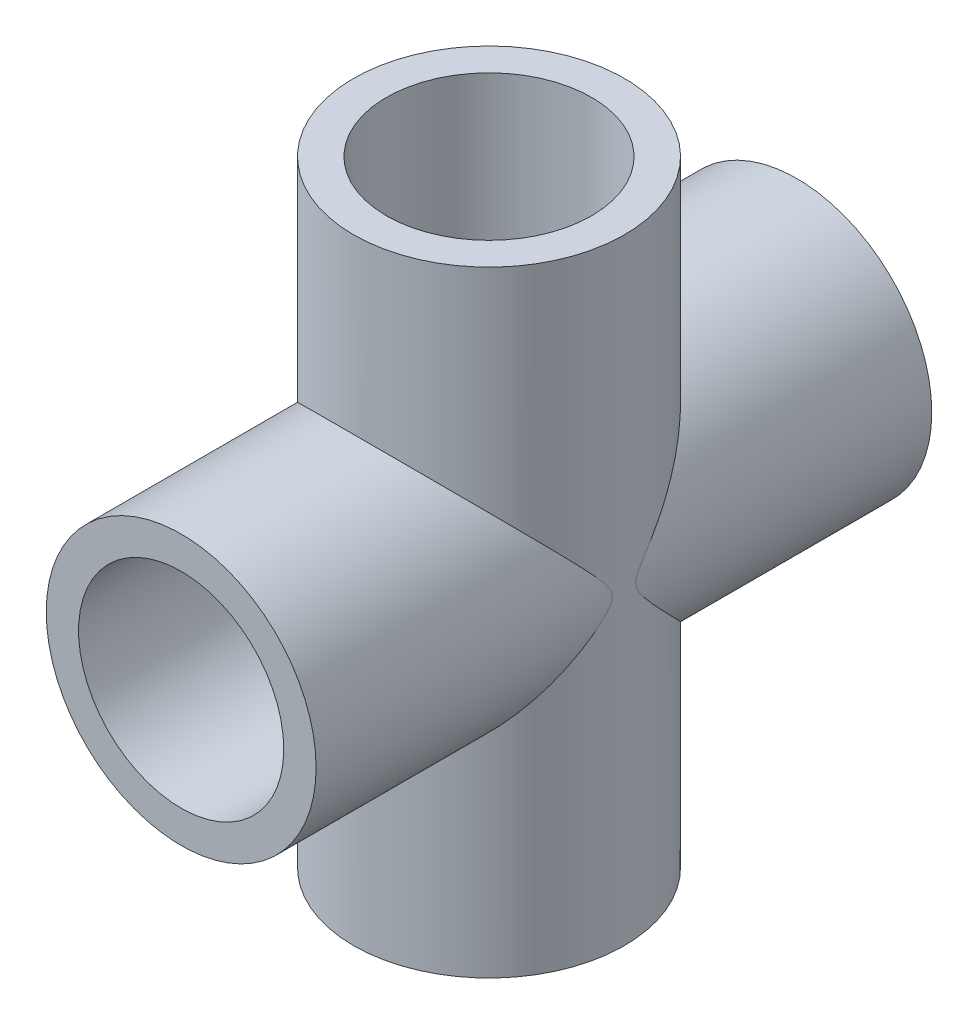
ISO-10303-21;
HEADER;
FILE_DESCRIPTION(('STEP AP214'),'2;1');
FILE_NAME('part.step','',(''),(''),'','','');
FILE_SCHEMA(('AUTOMOTIVE_DESIGN { 1 0 10303 214 1 1 1 1 }'));
ENDSEC;
DATA;
#1=APPLICATION_CONTEXT('core data for automotive mechanical design processes');
#2=APPLICATION_PROTOCOL_DEFINITION('international standard','automotive_design',2000,#1);
#3=PRODUCT_CONTEXT('',#1,'mechanical');
#4=PRODUCT('Part','Part','',(#3));
#5=PRODUCT_RELATED_PRODUCT_CATEGORY('part','',(#4));
#6=PRODUCT_DEFINITION_FORMATION('','',#4);
#7=PRODUCT_DEFINITION_CONTEXT('part definition',#1,'design');
#8=PRODUCT_DEFINITION('design','',#6,#7);
#9=PRODUCT_DEFINITION_SHAPE('','',#8);
#10=(LENGTH_UNIT() NAMED_UNIT(*) SI_UNIT(.MILLI.,.METRE.));
#11=(NAMED_UNIT(*) PLANE_ANGLE_UNIT() SI_UNIT($,.RADIAN.));
#12=(NAMED_UNIT(*) SI_UNIT($,.STERADIAN.) SOLID_ANGLE_UNIT());
#13=UNCERTAINTY_MEASURE_WITH_UNIT(LENGTH_MEASURE(1.E-05),#10,'distance_accuracy_value','');
#14=(GEOMETRIC_REPRESENTATION_CONTEXT(3) GLOBAL_UNCERTAINTY_ASSIGNED_CONTEXT((#13)) GLOBAL_UNIT_ASSIGNED_CONTEXT((#10,
#11,#12)) REPRESENTATION_CONTEXT('',''));
#15=CARTESIAN_POINT('',(0.,0.,0.));
#16=DIRECTION('',(0.,0.,1.));
#17=DIRECTION('',(1.,0.,0.));
#18=AXIS2_PLACEMENT_3D('',#15,#16,#17);
#19=CARTESIAN_POINT('',(0.,0.,76.2));
#20=DIRECTION('',(0.,0.,-1.));
#21=DIRECTION('',(-1.,0.,0.));
#22=AXIS2_PLACEMENT_3D('',#19,#20,#21);
#23=CYLINDRICAL_SURFACE('',#22,12.7);
#24=CARTESIAN_POINT('',(0.,0.,38.1));
#25=DIRECTION('',(0.,-0.707106781186547,-0.707106781186547));
#26=DIRECTION('',(0.,0.707106781186547,-0.707106781186547));
#27=AXIS2_PLACEMENT_3D('',#24,#25,#26);
#28=ELLIPSE('',#27,17.9605122421383,12.7);
#29=CARTESIAN_POINT('',(-12.7,0.,38.1));
#30=VERTEX_POINT('',#29);
#31=CARTESIAN_POINT('',(12.7,0.,38.1));
#32=VERTEX_POINT('',#31);
#33=EDGE_CURVE('E11',#30,#32,#28,.F.);
#34=ORIENTED_EDGE('',*,*,#33,.F.);
#35=CARTESIAN_POINT('',(0.,0.,38.1));
#36=DIRECTION('',(0.,-0.707106781186547,0.707106781186547));
#37=DIRECTION('',(0.,-0.707106781186547,-0.707106781186547));
#38=AXIS2_PLACEMENT_3D('',#35,#36,#37);
#39=ELLIPSE('',#38,17.9605122421383,12.7);
#40=EDGE_CURVE('E55',#30,#32,#39,.F.);
#41=ORIENTED_EDGE('',*,*,#40,.T.);
#42=EDGE_LOOP('',(#34,#41));
#43=FACE_BOUND('',#42,.T.);
#44=CARTESIAN_POINT('',(0.,0.,76.2));
#45=DIRECTION('',(0.,0.,1.));
#46=DIRECTION('',(1.,0.,0.));
#47=AXIS2_PLACEMENT_3D('',#44,#45,#46);
#48=CIRCLE('',#47,12.7);
#49=CARTESIAN_POINT('',(12.7,0.,76.2));
#50=VERTEX_POINT('',#49);
#51=EDGE_CURVE('E131',#50,#50,#48,.T.);
#52=ORIENTED_EDGE('',*,*,#51,.T.);
#53=EDGE_LOOP('',(#52));
#54=FACE_BOUND('',#53,.T.);
#55=ADVANCED_FACE('F32',(#43,#54),#23,.F.);
#56=CARTESIAN_POINT('',(0.,0.,76.2));
#57=DIRECTION('',(0.,0.,-1.));
#58=DIRECTION('',(-1.,0.,0.));
#59=AXIS2_PLACEMENT_3D('',#56,#57,#58);
#60=CYLINDRICAL_SURFACE('',#59,16.7005);
#61=CARTESIAN_POINT('',(0.,0.,76.2));
#62=DIRECTION('',(0.,0.,1.));
#63=DIRECTION('',(1.,0.,0.));
#64=AXIS2_PLACEMENT_3D('',#61,#62,#63);
#65=CIRCLE('',#64,16.7005);
#66=CARTESIAN_POINT('',(16.7005,0.,76.2));
#67=VERTEX_POINT('',#66);
#68=EDGE_CURVE('E86',#67,#67,#65,.T.);
#69=ORIENTED_EDGE('',*,*,#68,.F.);
#70=EDGE_LOOP('',(#69));
#71=FACE_BOUND('',#70,.T.);
#72=CARTESIAN_POINT('',(-16.7005,0.,39.5577365159727));
#73=CARTESIAN_POINT('',(-16.7004971946877,0.109377941611849,39.5577881761286));
#74=CARTESIAN_POINT('',(-16.6994042441671,0.218833310366565,39.5704513220979));
#75=CARTESIAN_POINT('',(-16.6952279831685,0.433349002507215,39.6170762949017));
#76=CARTESIAN_POINT('',(-16.6921317169307,0.538375943308756,39.6511767189807));
#77=CARTESIAN_POINT('',(-16.6838144556186,0.755140052959844,39.7383410327404));
#78=CARTESIAN_POINT('',(-16.6783775616868,0.866093816107272,39.7932323789569));
#79=CARTESIAN_POINT('',(-16.6657478078138,1.08226559654692,39.9133453628733));
#80=CARTESIAN_POINT('',(-16.6585507741035,1.18746924240747,39.9785914233685));
#81=CARTESIAN_POINT('',(-16.6425139811608,1.39436878573821,40.115746845307));
#82=CARTESIAN_POINT('',(-16.633662423503,1.49603284494996,40.1877020771601));
#83=CARTESIAN_POINT('',(-16.6144480732112,1.69613718046101,40.3354833615605));
#84=CARTESIAN_POINT('',(-16.6040870705458,1.79458110833297,40.4113047611527));
#85=CARTESIAN_POINT('',(-16.5678042083091,2.11285815155546,40.6633227126372));
#86=CARTESIAN_POINT('',(-16.5388239334411,2.32816370963601,40.8447667174249));
#87=CARTESIAN_POINT('',(-16.4734527962265,2.75281906209883,41.213250812085));
#88=CARTESIAN_POINT('',(-16.4370583403272,2.96216591208411,41.4002935779557));
#89=CARTESIAN_POINT('',(-16.3568184553963,3.37726985372258,41.7774158406208));
#90=CARTESIAN_POINT('',(-16.3129615282301,3.5830208571684,41.9674996072154));
#91=CARTESIAN_POINT('',(-16.2178226373663,3.99160010086575,42.3488336550599));
#92=CARTESIAN_POINT('',(-16.1665422115659,4.19442893694534,42.5400836868578));
#93=CARTESIAN_POINT('',(-16.0017768968227,4.79831329615684,43.1132284540607));
#94=CARTESIAN_POINT('',(-15.8771399194564,5.19594081635482,43.4956037245185));
#95=CARTESIAN_POINT('',(-15.5976015091929,5.98294344320413,44.2572070064692));
#96=CARTESIAN_POINT('',(-15.4427181927199,6.37232333588253,44.6364367609584));
#97=CARTESIAN_POINT('',(-15.0504369928404,7.25890832642233,45.5030680079411));
#98=CARTESIAN_POINT('',(-14.8022406199555,7.75322242679633,45.9886058968734));
#99=CARTESIAN_POINT('',(-14.2509760219082,8.72516959857842,46.945711744899));
#100=CARTESIAN_POINT('',(-13.9478806057969,9.20279426340525,47.4172726460462));
#101=CARTESIAN_POINT('',(-13.2847749421974,10.1365250866551,48.3405712003102));
#102=CARTESIAN_POINT('',(-12.9248096057687,10.592647859479,48.7923241394311));
#103=CARTESIAN_POINT('',(-12.1454197849747,11.4779298351004,49.6699844262983));
#104=CARTESIAN_POINT('',(-11.7260365098409,11.9071074304503,50.0959093970672));
#105=CARTESIAN_POINT('',(-10.9945170038697,12.5766755760574,50.7608395975585));
#106=CARTESIAN_POINT('',(-10.7011206718141,12.8275198743983,51.010055686369));
#107=CARTESIAN_POINT('',(-10.0898414119314,13.3136869959685,51.4932269916807));
#108=CARTESIAN_POINT('',(-9.77196075006493,13.5490112518045,51.7271836167129));
#109=CARTESIAN_POINT('',(-9.11203894729865,14.0013309725647,52.176991875005));
#110=CARTESIAN_POINT('',(-8.77002912563001,14.2183494226331,52.3928662103069));
#111=CARTESIAN_POINT('',(-8.06180913310757,14.63153830433,52.8039612861403));
#112=CARTESIAN_POINT('',(-7.69560288265102,14.8277120999202,52.9991853592387));
#113=CARTESIAN_POINT('',(-7.00637065900624,15.1636904396835,53.3335908035655));
#114=CARTESIAN_POINT('',(-6.68706983845536,15.3073420561721,53.4765911913435));
#115=CARTESIAN_POINT('',(-6.03361467621218,15.5764884462261,53.7445462716977));
#116=CARTESIAN_POINT('',(-5.69946352186493,15.7019870916172,53.8695048123879));
#117=CARTESIAN_POINT('',(-5.01771485701723,15.9329443705381,54.0994874861398));
#118=CARTESIAN_POINT('',(-4.67012105297363,16.0384084813136,54.204517067575));
#119=CARTESIAN_POINT('',(-3.96326901171396,16.2275391568857,54.3928803586232));
#120=CARTESIAN_POINT('',(-3.60401068440611,16.311205553281,54.4762139006203));
#121=CARTESIAN_POINT('',(-2.87368534667217,16.455641434504,54.6200814001919));
#122=CARTESIAN_POINT('',(-2.50255326719795,16.5162464989572,54.6804516351712));
#123=CARTESIAN_POINT('',(-1.7538545920992,16.6124388527953,54.7762736416118));
#124=CARTESIAN_POINT('',(-1.37628797058831,16.6480260415081,54.8117253128009));
#125=CARTESIAN_POINT('',(-0.618212359159072,16.6933711926294,54.8568980905866));
#126=CARTESIAN_POINT('',(-0.237704553993179,16.7031390618951,54.8666290661986));
#127=CARTESIAN_POINT('',(0.522846620795012,16.6966437967895,54.860158403037));
#128=CARTESIAN_POINT('',(0.902890028588318,16.6803829692777,54.8439590624039));
#129=CARTESIAN_POINT('',(1.61605969780274,16.6255253464845,54.7893104696267));
#130=CARTESIAN_POINT('',(1.94961448314265,16.5896736608336,54.7535957657123));
#131=CARTESIAN_POINT('',(2.6113276693388,16.4984602799764,54.6627344151639));
#132=CARTESIAN_POINT('',(2.93948656797637,16.4431003951299,54.6075895716458));
#133=CARTESIAN_POINT('',(3.58841718195762,16.3137809223338,54.4787792861818));
#134=CARTESIAN_POINT('',(3.90918840304576,16.2398200938541,54.4051126089817));
#135=CARTESIAN_POINT('',(4.54162240193788,16.0744275028447,54.2403890937314));
#136=CARTESIAN_POINT('',(4.85328463027853,15.9829946888852,54.1493312091127));
#137=CARTESIAN_POINT('',(5.47913529912896,15.7796891940698,53.9468765638436));
#138=CARTESIAN_POINT('',(5.79286773258255,15.667112741553,53.8347796476714));
#139=CARTESIAN_POINT('',(6.40771197568703,15.4258552059127,53.5945757536515));
#140=CARTESIAN_POINT('',(6.70882383367645,15.2971741844794,53.4664688371317));
#141=CARTESIAN_POINT('',(7.29767109354589,15.0251756733772,53.195718934967));
#142=CARTESIAN_POINT('',(7.58540334464515,14.8818547612894,53.053072550396));
#143=CARTESIAN_POINT('',(8.14691768873243,14.5820362906594,52.7547112052524));
#144=CARTESIAN_POINT('',(8.42069673206444,14.4255358712203,52.5989934072704));
#145=CARTESIAN_POINT('',(9.0989298012114,14.012435988985,52.1880341449431));
#146=CARTESIAN_POINT('',(9.49354758822166,13.7476557864667,51.9246935012395));
#147=CARTESIAN_POINT('',(10.2485226696862,13.1944574023431,51.3747058662491));
#148=CARTESIAN_POINT('',(10.6088652950383,12.9060291973056,51.0880489925677));
#149=CARTESIAN_POINT('',(11.2964581898908,12.3087205559965,50.4946929414861));
#150=CARTESIAN_POINT('',(11.6236261397893,11.9997922456727,50.1879468731337));
#151=CARTESIAN_POINT('',(12.2446357648759,11.3654142513624,49.5584511030661));
#152=CARTESIAN_POINT('',(12.5384782421173,11.0399649652638,49.2357017867741));
#153=CARTESIAN_POINT('',(13.2001721119357,10.247970342333,48.4509416631894));
#154=CARTESIAN_POINT('',(13.5533244273638,9.77508283402438,47.9828953557696));
#155=CARTESIAN_POINT('',(14.2006346440247,8.80836563732624,47.0278606111641));
#156=CARTESIAN_POINT('',(14.4947635931303,8.31452581458837,46.5408630171498));
#157=CARTESIAN_POINT('',(15.0261057459156,7.3106165745748,45.5539492906826));
#158=CARTESIAN_POINT('',(15.2633781188113,6.80056466063715,45.0540471932473));
#159=CARTESIAN_POINT('',(15.5783301691151,6.02495416655496,44.2985292768195));
#160=CARTESIAN_POINT('',(15.6764761593502,5.76470271519629,44.0457851321397));
#161=CARTESIAN_POINT('',(15.8593704264658,5.24062241071755,43.5391682774392));
#162=CARTESIAN_POINT('',(15.9441196365541,4.97679380816998,43.2852956472955));
#163=CARTESIAN_POINT('',(16.1089450275244,4.41622301922161,42.74977814086));
#164=CARTESIAN_POINT('',(16.1874974431869,4.11903578832237,42.4681312993222));
#165=CARTESIAN_POINT('',(16.3284719284011,3.51893098982689,41.9073515844358));
#166=CARTESIAN_POINT('',(16.3909071950102,3.21601832987026,41.6282168360645));
#167=CARTESIAN_POINT('',(16.4808612513591,2.7072885195394,41.1735233057384));
#168=CARTESIAN_POINT('',(16.5129739444785,2.50431093134066,40.9956804601354));
#169=CARTESIAN_POINT('',(16.5703554191,2.0913521764185,40.6467548408669));
#170=CARTESIAN_POINT('',(16.5956219123607,1.88136869435109,40.475674343695));
#171=CARTESIAN_POINT('',(16.6303456877539,1.53470269896479,40.214983667898));
#172=CARTESIAN_POINT('',(16.6420870592141,1.40223155303702,40.1201198853233));
#173=CARTESIAN_POINT('',(16.6628165045685,1.1296056387351,39.9412506854416));
#174=CARTESIAN_POINT('',(16.6718053251459,0.989452966309142,39.8572423269696));
#175=CARTESIAN_POINT('',(16.6838151142341,0.75192286887624,39.7383500333531));
#176=CARTESIAN_POINT('',(16.6878122962417,0.658020970420006,39.6968157101605));
#177=CARTESIAN_POINT('',(16.6942945985817,0.465251318751511,39.6275599552889));
#178=CARTESIAN_POINT('',(16.6967846780986,0.366401023997692,39.5997932757278));
#179=CARTESIAN_POINT('',(16.6997248767064,0.181533409722611,39.5666749972553));
#180=CARTESIAN_POINT('',(16.7004426181088,0.0960708322746923,39.5583936810184));
#181=CARTESIAN_POINT('',(16.7005506669624,-0.0748912330378882,39.5571562790181));
#182=CARTESIAN_POINT('',(16.6999422164908,-0.160390611447141,39.5641858534635));
#183=CARTESIAN_POINT('',(16.6971083977953,-0.35384356265999,39.5961858326484));
#184=CARTESIAN_POINT('',(16.6944590524759,-0.460981946299804,39.6258363401814));
#185=CARTESIAN_POINT('',(16.6873993123283,-0.669652510648679,39.7011935492045));
#186=CARTESIAN_POINT('',(16.6829786996375,-0.771148203188232,39.7469932227392));
#187=CARTESIAN_POINT('',(16.6692357370303,-1.03467717021753,39.8819451065387));
#188=CARTESIAN_POINT('',(16.6586084237604,-1.19210027715894,39.9796768304122));
#189=CARTESIAN_POINT('',(16.6338533551076,-1.49839954480143,40.1875355450997));
#190=CARTESIAN_POINT('',(16.6197148220498,-1.64724761828511,40.2977001196323));
#191=CARTESIAN_POINT('',(16.5880463684486,-1.94042545100835,40.5252190034094));
#192=CARTESIAN_POINT('',(16.5704962540407,-2.08472204593027,40.6426131298173));
#193=CARTESIAN_POINT('',(16.5321720596972,-2.36950646997783,40.8809321525774));
#194=CARTESIAN_POINT('',(16.5114028702622,-2.50999970310247,41.0018514707836));
#195=CARTESIAN_POINT('',(16.4444486432232,-2.92676379448886,41.3669095336551));
#196=CARTESIAN_POINT('',(16.3934917165784,-3.19944980849916,41.6142717139342));
#197=CARTESIAN_POINT('',(16.2788286278479,-3.73930254412422,42.1120997513183));
#198=CARTESIAN_POINT('',(16.2151194481716,-4.00646794284555,42.3625663298388));
#199=CARTESIAN_POINT('',(16.0747612196812,-4.53697443069057,42.8646364773455));
#200=CARTESIAN_POINT('',(15.9980957476251,-4.80031019946608,43.1162410899392));
#201=CARTESIAN_POINT('',(15.8317382307769,-5.3233487217964,43.6188646496097));
#202=CARTESIAN_POINT('',(15.742047379626,-5.58305180586097,43.8698836482126));
#203=CARTESIAN_POINT('',(15.5497422811087,-6.09815967290197,44.3696630436253));
#204=CARTESIAN_POINT('',(15.4471694166436,-6.35357537596929,44.6184280533976));
#205=CARTESIAN_POINT('',(15.228669842484,-6.86079887157115,45.1137436036806));
#206=CARTESIAN_POINT('',(15.1127426924646,-7.11260654483178,45.3602940708832));
#207=CARTESIAN_POINT('',(14.7446963642306,-7.86195638951252,46.095362152033));
#208=CARTESIAN_POINT('',(14.4721612240776,-8.35383282073925,46.5796932171819));
#209=CARTESIAN_POINT('',(13.9240505314982,-9.2328725062245,47.4470264510503));
#210=CARTESIAN_POINT('',(13.6576311009812,-9.62310420381735,47.8327338689883));
#211=CARTESIAN_POINT('',(13.0850661041771,-10.3882662437671,48.5899002370064));
#212=CARTESIAN_POINT('',(12.7789153507437,-10.7631945797683,48.961357318407));
#213=CARTESIAN_POINT('',(12.1257830121768,-11.4940020219734,49.6859762323605));
#214=CARTESIAN_POINT('',(11.7788349731252,-11.8498964335275,50.0391527568872));
#215=CARTESIAN_POINT('',(11.0426855158628,-12.5387280396919,50.7231147827487));
#216=CARTESIAN_POINT('',(10.6535005138663,-12.8716740719477,51.0539089028575));
#217=CARTESIAN_POINT('',(9.94886415440954,-13.4188416329112,51.5977658323323));
#218=CARTESIAN_POINT('',(9.64389814709539,-13.639909807907,51.8175668413048));
#219=CARTESIAN_POINT('',(9.0118277600854,-14.065517311743,52.2408371848254));
#220=CARTESIAN_POINT('',(8.68472499014032,-14.2700578400797,52.444307704554));
#221=CARTESIAN_POINT('',(8.00905020140445,-14.6599382034647,52.8322232789863));
#222=CARTESIAN_POINT('',(7.66050148623438,-14.8452983127021,53.0166884219453));
#223=CARTESIAN_POINT('',(6.94243536491331,-15.1943594142217,53.3641170568847));
#224=CARTESIAN_POINT('',(6.57292147970828,-15.3580640280903,53.5270841441092));
#225=CARTESIAN_POINT('',(5.87914046479447,-15.6351254932654,53.8029298893534));
#226=CARTESIAN_POINT('',(5.55790876815175,-15.7523071504598,53.9196105762249));
#227=CARTESIAN_POINT('',(4.90332770196237,-15.9681804330761,54.1345777753451));
#228=CARTESIAN_POINT('',(4.56998073381331,-16.0668756991216,54.2328679093393));
#229=CARTESIAN_POINT('',(3.89293497443916,-16.2442038058654,54.4094785193721));
#230=CARTESIAN_POINT('',(3.54924018801426,-16.3228442993255,54.4878066127792));
#231=CARTESIAN_POINT('',(2.85349147727876,-16.4587332744007,54.6231613344299));
#232=CARTESIAN_POINT('',(2.50143747061554,-16.5159815451727,54.6801877527229));
#233=CARTESIAN_POINT('',(1.78977648504214,-16.6082133378475,54.7720643461588));
#234=CARTESIAN_POINT('',(1.43014115848807,-16.6430875460863,54.8068056420415));
#235=CARTESIAN_POINT('',(0.70786411509884,-16.6894151269827,54.8529570207472));
#236=CARTESIAN_POINT('',(0.345222393654528,-16.7008684637269,54.864367067794));
#237=CARTESIAN_POINT('',(-0.37997278190831,-16.7001134591284,54.8636149235353));
#238=CARTESIAN_POINT('',(-0.742526241256664,-16.6879075303051,54.8514551356299));
#239=CARTESIAN_POINT('',(-1.46452681619334,-16.6400944770499,54.803823981458));
#240=CARTESIAN_POINT('',(-1.82397404742528,-16.6044882276383,54.7683534868609));
#241=CARTESIAN_POINT('',(-2.5093783934049,-16.5142318429873,54.6784448852182));
#242=CARTESIAN_POINT('',(-2.83578044118749,-16.4612621562355,54.6256805369926));
#243=CARTESIAN_POINT('',(-3.48146835329843,-16.3368958510236,54.5018026900799));
#244=CARTESIAN_POINT('',(-3.80075481647235,-16.2655007896485,54.4306907419054));
#245=CARTESIAN_POINT('',(-4.43058879653931,-16.1053469493424,54.2711825327218));
#246=CARTESIAN_POINT('',(-4.74113435718152,-16.0165843182693,54.1827824371888));
#247=CARTESIAN_POINT('',(-5.35206251284874,-15.8229222413758,53.9899271908944));
#248=CARTESIAN_POINT('',(-5.65244313589478,-15.7180196860864,53.885468946422));
#249=CARTESIAN_POINT('',(-6.33903396162662,-15.4563613620895,53.6249447307052));
#250=CARTESIAN_POINT('',(-6.72093852001559,-15.2939052669126,53.4632110928211));
#251=CARTESIAN_POINT('',(-7.4631048753631,-14.9457989979111,53.1167115045902));
#252=CARTESIAN_POINT('',(-7.82336091266575,-14.7601426917036,52.9319394646593));
#253=CARTESIAN_POINT('',(-8.52164898963792,-14.3683219525147,52.5420666760751));
#254=CARTESIAN_POINT('',(-8.85965287356519,-14.1621323367175,52.3369409660625));
#255=CARTESIAN_POINT('',(-9.51253687663765,-13.7321223546547,51.9092606981424));
#256=CARTESIAN_POINT('',(-9.82741585633397,-13.5083011207392,51.6867052825243));
#257=CARTESIAN_POINT('',(-10.5437819748864,-12.961684280244,51.1433533748708));
#258=CARTESIAN_POINT('',(-10.9354316046256,-12.6323576818181,50.8161255611257));
#259=CARTESIAN_POINT('',(-11.6767208673117,-11.9505095576545,50.1390222813422));
#260=CARTESIAN_POINT('',(-12.0263454725649,-11.5979798040447,49.7891387822861));
#261=CARTESIAN_POINT('',(-12.6854857252126,-10.8731617123777,49.0703445309967));
#262=CARTESIAN_POINT('',(-12.994908113909,-10.5008301604785,48.701392218476));
#263=CARTESIAN_POINT('',(-13.5741147113436,-9.74055880150926,47.948884310526));
#264=CARTESIAN_POINT('',(-13.8439007639144,-9.35261972155199,47.5653293954371));
#265=CARTESIAN_POINT('',(-14.2642854842871,-8.69120039664211,46.9124986370356));
#266=CARTESIAN_POINT('',(-14.4252469295607,-8.42119416696529,46.6462980436001));
#267=CARTESIAN_POINT('',(-14.7300654944841,-7.87587791547306,46.1095027965202));
#268=CARTESIAN_POINT('',(-14.8739210687909,-7.60056741707721,45.838907748387));
#269=CARTESIAN_POINT('',(-15.1449500806872,-7.04505226762903,45.2940812001073));
#270=CARTESIAN_POINT('',(-15.2721141264537,-6.76484496090534,45.0198477474736));
#271=CARTESIAN_POINT('',(-15.5099909186737,-6.20006190556572,44.4688238588786));
#272=CARTESIAN_POINT('',(-15.620705218542,-5.91548657224366,44.1920336669859));
#273=CARTESIAN_POINT('',(-15.8256015792983,-5.34313638442774,43.6379523290158));
#274=CARTESIAN_POINT('',(-15.9198443040162,-5.05537760642645,43.3606669908406));
#275=CARTESIAN_POINT('',(-16.0925689675432,-4.47521511045564,42.8058861017224));
#276=CARTESIAN_POINT('',(-16.171046401592,-4.18281009055501,42.5283905133738));
#277=CARTESIAN_POINT('',(-16.3123817898295,-3.59238726140146,41.9754445655107));
#278=CARTESIAN_POINT('',(-16.3752423813432,-3.29437040901523,41.6999938682938));
#279=CARTESIAN_POINT('',(-16.4578623861993,-2.84059987151019,41.2921424074956));
#280=CARTESIAN_POINT('',(-16.4834524469787,-2.68825659116854,41.1571114641748));
#281=CARTESIAN_POINT('',(-16.5307333801916,-2.38030682991,40.8901373069488));
#282=CARTESIAN_POINT('',(-16.552424981557,-2.22470096511813,40.7581935198302));
#283=CARTESIAN_POINT('',(-16.5911661773112,-1.91404232914028,40.5043324648337));
#284=CARTESIAN_POINT('',(-16.6083518575724,-1.7591614394486,40.3822258528447));
#285=CARTESIAN_POINT('',(-16.6388839079133,-1.44210620285471,40.1476816433456));
#286=CARTESIAN_POINT('',(-16.652239143411,-1.27994971852653,40.0352221481665));
#287=CARTESIAN_POINT('',(-16.6704587441075,-1.00670305754688,39.8696433290742));
#288=CARTESIAN_POINT('',(-16.6766215493679,-0.899605421984924,39.8102075014641));
#289=CARTESIAN_POINT('',(-16.6870684722541,-0.678681435737127,39.7050560280454));
#290=CARTESIAN_POINT('',(-16.6913574169905,-0.564873241298256,39.6593052264188));
#291=CARTESIAN_POINT('',(-16.6964494775248,-0.374894319431464,39.6035812761558));
#292=CARTESIAN_POINT('',(-16.6979578704308,-0.300852180494259,39.5866190987592));
#293=CARTESIAN_POINT('',(-16.6999827187964,-0.151215748697161,39.5636941907989));
#294=CARTESIAN_POINT('',(-16.7005019396564,-0.075626381960889,39.5577007969728));
#295=CARTESIAN_POINT('',(-16.7005,0.,39.5577365159727));
#296=B_SPLINE_CURVE_WITH_KNOTS('',3,(#72,#73,#74,#75,#76,#77,#78,#79,#80,#81,#82,#83,#84,#85,
#86,#87,#88,#89,#90,#91,#92,#93,#94,#95,#96,#97,#98,#99,#100,#101,#102,#103,#104,#105,#106,#107,
#108,#109,#110,#111,#112,#113,#114,#115,#116,#117,#118,#119,#120,#121,#122,#123,#124,#125,#126,
#127,#128,#129,#130,#131,#132,#133,#134,#135,#136,#137,#138,#139,#140,#141,#142,#143,#144,#145,
#146,#147,#148,#149,#150,#151,#152,#153,#154,#155,#156,#157,#158,#159,#160,#161,#162,#163,#164,
#165,#166,#167,#168,#169,#170,#171,#172,#173,#174,#175,#176,#177,#178,#179,#180,#181,#182,#183,
#184,#185,#186,#187,#188,#189,#190,#191,#192,#193,#194,#195,#196,#197,#198,#199,#200,#201,#202,
#203,#204,#205,#206,#207,#208,#209,#210,#211,#212,#213,#214,#215,#216,#217,#218,#219,#220,#221,
#222,#223,#224,#225,#226,#227,#228,#229,#230,#231,#232,#233,#234,#235,#236,#237,#238,#239,#240,
#241,#242,#243,#244,#245,#246,#247,#248,#249,#250,#251,#252,#253,#254,#255,#256,#257,#258,#259,
#260,#261,#262,#263,#264,#265,#266,#267,#268,#269,#270,#271,#272,#273,#274,#275,#276,#277,#278,
#279,#280,#281,#282,#283,#284,#285,#286,#287,#288,#289,#290,#291,#292,#293,#294,#295),
.UNSPECIFIED.,.T.,.F.,(4,2,2,2,2,2,2,2,2,2,2,2,2,2,2,2,2,2,2,2,2,2,2,2,2,2,2,2,2,2,2,2,2,2,2,2,
2,2,2,2,2,2,2,2,2,2,2,2,2,2,2,2,2,2,2,2,2,2,2,2,2,2,2,2,2,2,2,2,2,2,2,2,2,2,2,2,2,2,2,2,2,2,2,2,
2,2,2,2,2,2,2,2,2,2,2,2,2,2,2,2,2,2,2,2,2,2,2,2,2,2,2,4),(0.,0.327735287216822,
0.657611567124788,1.02840239435844,1.4000811405967,1.77451910915954,2.14851661284984,
2.99723388176963,3.84636349533043,4.69681349087164,5.5470875534646,7.24279583433119,
8.93749154751042,11.1432019235286,13.3500077681857,15.5550794959982,17.758629318284,
19.1360418096651,20.5133269779444,21.8888562253561,23.2641631482359,24.3977167195367,
25.5310281588906,26.6640293146679,27.7970392233448,28.9379821945265,30.0789297568404,
31.2194394746748,32.3598481175248,33.3707984171602,34.3816549253657,35.3925788672862,
36.4035636637953,37.4575334992777,38.5114992975428,39.5657120514652,40.6201542378506,
42.2475965712697,43.8757323136015,45.5078140232224,47.1398564447498,49.3963336100022,
51.6539149307706,53.9091365393979,55.0364008112517,56.1635865242447,57.4140002366635,
58.6633868131226,59.478593327133,60.2940719767488,60.7839250345688,61.2736450922338,
61.5812447965762,61.8878267488497,62.1441187384125,62.4001707946331,62.7317453354031,
63.0652608119645,63.6204911614105,64.1774473214905,64.7378065370071,65.2973226374324,
66.4119644684716,67.526870371873,68.6432002650357,69.7594279225876,70.8721573195047,
71.9849234164461,74.2086947918637,76.0370812446842,77.8657066441675,79.6928388114857,
81.519263354667,82.8265422662984,84.1337262165868,85.4395140141204,86.7450831596227,
87.8279211685114,88.9105457036062,89.9927564964381,91.0749779553243,92.1624473825251,
93.2499184772505,94.3372786891112,95.4245982430611,96.4280630020331,97.4314429883195,
98.4350457779566,99.438842161339,100.773157355832,102.107825991447,103.444152159608,
104.780544129346,106.600015882908,108.420136336415,110.244406349695,112.068591473338,
113.303954627618,114.539429299853,115.77559618363,117.011646256964,118.243043440286,
119.474791983045,120.706332370241,121.321804013879,121.937160456949,122.530942404095,
123.123338766196,123.490769530892,123.857248122588,124.084487936074,124.311091524036),.UNSPECIFIED.);
#297=CARTESIAN_POINT('',(-16.7005,0.,39.5577365159727));
#298=VERTEX_POINT('',#297);
#299=EDGE_CURVE('E51',#298,#298,#296,.T.);
#300=ORIENTED_EDGE('',*,*,#299,.F.);
#301=EDGE_LOOP('',(#300));
#302=FACE_BOUND('',#301,.T.);
#303=ADVANCED_FACE('F34',(#71,#302),#60,.T.);
#304=CARTESIAN_POINT('',(0.,0.,76.2));
#305=DIRECTION('',(0.,0.,1.));
#306=DIRECTION('',(1.,0.,0.));
#307=AXIS2_PLACEMENT_3D('',#304,#305,#306);
#308=PLANE('',#307);
#309=ORIENTED_EDGE('',*,*,#68,.T.);
#310=EDGE_LOOP('',(#309));
#311=FACE_BOUND('',#310,.T.);
#312=ORIENTED_EDGE('',*,*,#51,.F.);
#313=EDGE_LOOP('',(#312));
#314=FACE_BOUND('',#313,.T.);
#315=ADVANCED_FACE('F96',(#311,#314),#308,.T.);
#316=CARTESIAN_POINT('',(0.,38.1,38.1));
#317=DIRECTION('',(0.,-1.,0.));
#318=DIRECTION('',(0.,0.,-1.));
#319=AXIS2_PLACEMENT_3D('',#316,#317,#318);
#320=CYLINDRICAL_SURFACE('',#319,16.764);
#321=CARTESIAN_POINT('',(-16.7005,0.,36.6422634840273));
#322=CARTESIAN_POINT('',(-16.7004971946877,-0.109377941611843,36.6422118238714));
#323=CARTESIAN_POINT('',(-16.6994042441671,-0.218833310366562,36.6295486779021));
#324=CARTESIAN_POINT('',(-16.6952279831685,-0.433349002507202,36.5829237050982));
#325=CARTESIAN_POINT('',(-16.6921317169307,-0.53837594330873,36.5488232810193));
#326=CARTESIAN_POINT('',(-16.6838144556186,-0.755140052959788,36.4616589672596));
#327=CARTESIAN_POINT('',(-16.6783775616868,-0.866093816107204,36.4067676210431));
#328=CARTESIAN_POINT('',(-16.6657478078138,-1.08226559654682,36.2866546371268));
#329=CARTESIAN_POINT('',(-16.6585507741035,-1.18746924240735,36.2214085766315));
#330=CARTESIAN_POINT('',(-16.6425139811608,-1.39436878573804,36.0842531546931));
#331=CARTESIAN_POINT('',(-16.633662423503,-1.49603284494977,36.01229792284));
#332=CARTESIAN_POINT('',(-16.6144480732112,-1.69613718046078,35.8645166384397));
#333=CARTESIAN_POINT('',(-16.6040870705459,-1.79458110833273,35.7886952388475));
#334=CARTESIAN_POINT('',(-16.5678042083092,-2.11285815155517,35.5366772873631));
#335=CARTESIAN_POINT('',(-16.5388239334411,-2.32816370963568,35.3552332825754));
#336=CARTESIAN_POINT('',(-16.4734527962265,-2.7528190620984,34.9867491879154));
#337=CARTESIAN_POINT('',(-16.4370583403272,-2.96216591208364,34.7997064220447));
#338=CARTESIAN_POINT('',(-16.3568184553964,-3.37726985372202,34.4225841593797));
#339=CARTESIAN_POINT('',(-16.3129615282303,-3.58302085716781,34.2325003927851));
#340=CARTESIAN_POINT('',(-16.2178226373665,-3.99160010086509,33.8511663449407));
#341=CARTESIAN_POINT('',(-16.1665422115661,-4.19442893694463,33.6599163131429));
#342=CARTESIAN_POINT('',(-16.001776896823,-4.798313296156,33.0867715459401));
#343=CARTESIAN_POINT('',(-15.8771399194567,-5.19594081635389,32.7043962754823));
#344=CARTESIAN_POINT('',(-15.5976015091933,-5.98294344320304,31.9427929935318));
#345=CARTESIAN_POINT('',(-15.4427181927203,-6.37232333588137,31.5635632390428));
#346=CARTESIAN_POINT('',(-15.0504369928409,-7.25890832642116,30.69693199206));
#347=CARTESIAN_POINT('',(-14.8022406199561,-7.75322242679523,30.2113941031277));
#348=CARTESIAN_POINT('',(-14.2509760219089,-8.72516959857744,29.254288255102));
#349=CARTESIAN_POINT('',(-13.9478806057975,-9.20279426340433,28.7827273539547));
#350=CARTESIAN_POINT('',(-13.284774942198,-10.1365250866543,27.8594287996906));
#351=CARTESIAN_POINT('',(-12.9248096057693,-10.5926478594782,27.4076758605696));
#352=CARTESIAN_POINT('',(-12.1454197849753,-11.4779298350998,26.5300155737023));
#353=CARTESIAN_POINT('',(-11.7260365098415,-11.9071074304497,26.1040906029333));
#354=CARTESIAN_POINT('',(-10.9945170038703,-12.5766755760569,25.439160402442));
#355=CARTESIAN_POINT('',(-10.7011206718147,-12.8275198743978,25.1899443136314));
#356=CARTESIAN_POINT('',(-10.089841411932,-13.3136869959681,24.7067730083198));
#357=CARTESIAN_POINT('',(-9.77196075006552,-13.549011251804,24.4728163832875));
#358=CARTESIAN_POINT('',(-9.11203894729925,-14.0013309725643,24.0230081249954));
#359=CARTESIAN_POINT('',(-8.77002912563061,-14.2183494226327,23.8071337896934));
#360=CARTESIAN_POINT('',(-8.06180913310817,-14.6315383043297,23.3960387138601));
#361=CARTESIAN_POINT('',(-7.69560288265162,-14.8277120999199,23.2008146407616));
#362=CARTESIAN_POINT('',(-7.00637065900683,-15.1636904396832,22.8664091964348));
#363=CARTESIAN_POINT('',(-6.68706983845596,-15.3073420561719,22.7234088086568));
#364=CARTESIAN_POINT('',(-6.03361467621277,-15.5764884462259,22.4554537283025));
#365=CARTESIAN_POINT('',(-5.69946352186552,-15.701987091617,22.3304951876123));
#366=CARTESIAN_POINT('',(-5.01771485701782,-15.9329443705379,22.1005125138603));
#367=CARTESIAN_POINT('',(-4.67012105297421,-16.0384084813134,21.9954829324251));
#368=CARTESIAN_POINT('',(-3.96326901171454,-16.2275391568856,21.807119641377));
#369=CARTESIAN_POINT('',(-3.60401068440669,-16.3112055532809,21.7237860993798));
#370=CARTESIAN_POINT('',(-2.87368534667274,-16.4556414345039,21.5799185998082));
#371=CARTESIAN_POINT('',(-2.50255326719851,-16.5162464989571,21.5195483648289));
#372=CARTESIAN_POINT('',(-1.75385459209974,-16.6124388527952,21.4237263583882));
#373=CARTESIAN_POINT('',(-1.37628797058884,-16.6480260415081,21.3882746871991));
#374=CARTESIAN_POINT('',(-0.618212359159589,-16.6933711926294,21.3431019094134));
#375=CARTESIAN_POINT('',(-0.237704553993685,-16.7031390618951,21.3333709338014));
#376=CARTESIAN_POINT('',(0.522846620794529,-16.6966437967895,21.339841596963));
#377=CARTESIAN_POINT('',(0.902890028587846,-16.6803829692777,21.3560409375961));
#378=CARTESIAN_POINT('',(1.61605969780228,-16.6255253464846,21.4106895303732));
#379=CARTESIAN_POINT('',(1.9496144831422,-16.5896736608336,21.4464042342877));
#380=CARTESIAN_POINT('',(2.61132766933836,-16.4984602799765,21.537265584836));
#381=CARTESIAN_POINT('',(2.93948656797594,-16.4431003951299,21.5924104283541));
#382=CARTESIAN_POINT('',(3.58841718195719,-16.3137809223339,21.7212207138181));
#383=CARTESIAN_POINT('',(3.90918840304534,-16.2398200938542,21.7948873910182));
#384=CARTESIAN_POINT('',(4.54162240193747,-16.0744275028448,21.9596109062685));
#385=CARTESIAN_POINT('',(4.85328463027813,-15.9829946888853,22.0506687908872));
#386=CARTESIAN_POINT('',(5.47913529912857,-15.7796891940699,22.2531234361562));
#387=CARTESIAN_POINT('',(5.79286773258215,-15.6671127415532,22.3652203523284));
#388=CARTESIAN_POINT('',(6.40771197568664,-15.4258552059129,22.6054242463483));
#389=CARTESIAN_POINT('',(6.70882383367607,-15.2971741844795,22.7335311628681));
#390=CARTESIAN_POINT('',(7.29767109354551,-15.0251756733774,23.0042810650328));
#391=CARTESIAN_POINT('',(7.58540334464477,-14.8818547612896,23.1469274496038));
#392=CARTESIAN_POINT('',(8.14691768873205,-14.5820362906596,23.4452887947474));
#393=CARTESIAN_POINT('',(8.42069673206407,-14.4255358712205,23.6010065927293));
#394=CARTESIAN_POINT('',(9.09892980121103,-14.0124359889853,24.0119658550566));
#395=CARTESIAN_POINT('',(9.4935475882213,-13.7476557864669,24.2753064987602));
#396=CARTESIAN_POINT('',(10.2485226696858,-13.1944574023434,24.8252941337507));
#397=CARTESIAN_POINT('',(10.6088652950379,-12.9060291973059,25.111951007432));
#398=CARTESIAN_POINT('',(11.2964581898905,-12.3087205559968,25.7053070585136));
#399=CARTESIAN_POINT('',(11.6236261397889,-11.9997922456731,26.0120531268659));
#400=CARTESIAN_POINT('',(12.2446357648755,-11.3654142513628,26.6415488969335));
#401=CARTESIAN_POINT('',(12.5384782421169,-11.0399649652642,26.9642982132254));
#402=CARTESIAN_POINT('',(13.2001721119353,-10.2479703423335,27.7490583368101));
#403=CARTESIAN_POINT('',(13.5533244273634,-9.77508283402483,28.2171046442299));
#404=CARTESIAN_POINT('',(14.2006346440243,-8.80836563732673,29.1721393888354));
#405=CARTESIAN_POINT('',(14.49476359313,-8.31452581458888,29.6591369828497));
#406=CARTESIAN_POINT('',(15.0261057459153,-7.31061657457533,30.6460507093169));
#407=CARTESIAN_POINT('',(15.2633781188111,-6.8005646606377,31.1459528067521));
#408=CARTESIAN_POINT('',(15.5783301691149,-6.02495416655555,31.9014707231799));
#409=CARTESIAN_POINT('',(15.67647615935,-5.76470271519689,32.1542148678597));
#410=CARTESIAN_POINT('',(15.8593704264656,-5.24062241071817,32.6608317225602));
#411=CARTESIAN_POINT('',(15.9441196365539,-4.97679380817061,32.9147043527039));
#412=CARTESIAN_POINT('',(16.1089450275242,-4.41622301922221,33.4502218591394));
#413=CARTESIAN_POINT('',(16.1874974431868,-4.11903578832294,33.7318687006772));
#414=CARTESIAN_POINT('',(16.328471928401,-3.51893098982738,34.2926484155637));
#415=CARTESIAN_POINT('',(16.3909071950101,-3.21601832987073,34.571783163935));
#416=CARTESIAN_POINT('',(16.480861251359,-2.70728851953981,35.0264766942612));
#417=CARTESIAN_POINT('',(16.5129739444784,-2.50431093134104,35.2043195398642));
#418=CARTESIAN_POINT('',(16.5703554191,-2.09135217641882,35.5532451591329));
#419=CARTESIAN_POINT('',(16.5956219123607,-1.88136869435137,35.7243256563047));
#420=CARTESIAN_POINT('',(16.6303456877539,-1.53470269896502,35.9850163321018));
#421=CARTESIAN_POINT('',(16.6420870592141,-1.40223155303723,36.0798801146765));
#422=CARTESIAN_POINT('',(16.6628165045685,-1.12960563873529,36.2587493145583));
#423=CARTESIAN_POINT('',(16.6718053251459,-0.989452966309327,36.3427576730303));
#424=CARTESIAN_POINT('',(16.6838151142341,-0.7519228688764,36.4616499666468));
#425=CARTESIAN_POINT('',(16.6878122962417,-0.658020970420154,36.5031842898394));
#426=CARTESIAN_POINT('',(16.6942945985817,-0.465251318751652,36.5724400447111));
#427=CARTESIAN_POINT('',(16.6967846780986,-0.36640102399784,36.6002067242722));
#428=CARTESIAN_POINT('',(16.6997248767064,-0.181533409722764,36.6333250027447));
#429=CARTESIAN_POINT('',(16.7004426181088,-0.0960708322748471,36.6416063189816));
#430=CARTESIAN_POINT('',(16.7005506669624,0.0748912330377298,36.6428437209819));
#431=CARTESIAN_POINT('',(16.6999422164908,0.160390611446981,36.6358141465366));
#432=CARTESIAN_POINT('',(16.6971083977953,0.353843562659818,36.6038141673517));
#433=CARTESIAN_POINT('',(16.6944590524759,0.460981946299622,36.5741636598186));
#434=CARTESIAN_POINT('',(16.6873993123283,0.66965251064847,36.4988064507956));
#435=CARTESIAN_POINT('',(16.6829786996375,0.771148203188005,36.4530067772608));
#436=CARTESIAN_POINT('',(16.6692357370303,1.03467717021724,36.3180548934614));
#437=CARTESIAN_POINT('',(16.6586084237605,1.19210027715862,36.220323169588));
#438=CARTESIAN_POINT('',(16.6338533551076,1.49839954480103,36.0124644549005));
#439=CARTESIAN_POINT('',(16.6197148220498,1.64724761828465,35.902299880368));
#440=CARTESIAN_POINT('',(16.5880463684486,1.94042545100778,35.674780996591));
#441=CARTESIAN_POINT('',(16.5704962540408,2.08472204592965,35.5573868701832));
#442=CARTESIAN_POINT('',(16.5321720596973,2.36950646997712,35.3190678474231));
#443=CARTESIAN_POINT('',(16.5114028702623,2.50999970310171,35.1981485292171));
#444=CARTESIAN_POINT('',(16.4444486432234,2.92676379448796,34.8330904663457));
#445=CARTESIAN_POINT('',(16.3934917165786,3.19944980849817,34.5857282860667));
#446=CARTESIAN_POINT('',(16.2788286278482,3.73930254412304,34.0879002486828));
#447=CARTESIAN_POINT('',(16.2151194481719,4.00646794284426,33.8374336701624));
#448=CARTESIAN_POINT('',(16.0747612196816,4.53697443068908,33.3353635226559));
#449=CARTESIAN_POINT('',(15.9980957476256,4.80031019946449,33.0837589100623));
#450=CARTESIAN_POINT('',(15.8317382307775,5.32334872179462,32.581135350392));
#451=CARTESIAN_POINT('',(15.7420473796267,5.58305180585911,32.3301163517893));
#452=CARTESIAN_POINT('',(15.5497422811095,6.09815967289993,31.8303369563767));
#453=CARTESIAN_POINT('',(15.4471694166445,6.35357537596716,31.5815719466045));
#454=CARTESIAN_POINT('',(15.228669842485,6.86079887156884,31.0862563963216));
#455=CARTESIAN_POINT('',(15.1127426924657,7.11260654482939,30.8397059291191));
#456=CARTESIAN_POINT('',(14.744696364232,7.86195638950989,30.1046378479695));
#457=CARTESIAN_POINT('',(14.4721612240792,8.35383282073646,29.6203067828209));
#458=CARTESIAN_POINT('',(13.9240505315001,9.23287250622173,28.7529735489524));
#459=CARTESIAN_POINT('',(13.6576311009831,9.62310420381474,28.3672661310143));
#460=CARTESIAN_POINT('',(13.0850661041789,10.3882662437648,27.6100997629959));
#461=CARTESIAN_POINT('',(12.7789153507455,10.7631945797661,27.2386426815951));
#462=CARTESIAN_POINT('',(12.1257830121785,11.4940020219715,26.5140237676413));
#463=CARTESIAN_POINT('',(11.7788349731269,11.8498964335258,26.1608472431145));
#464=CARTESIAN_POINT('',(11.0426855158644,12.5387280396904,25.4768852172527));
#465=CARTESIAN_POINT('',(10.6535005138678,12.8716740719465,25.1460910971438));
#466=CARTESIAN_POINT('',(9.94886415441105,13.4188416329101,24.6022341676688));
#467=CARTESIAN_POINT('',(9.64389814709693,13.6399098079059,24.3824331586962));
#468=CARTESIAN_POINT('',(9.01182776008698,14.065517311742,23.9591628151756));
#469=CARTESIAN_POINT('',(8.68472499014192,14.2700578400787,23.755692295447));
#470=CARTESIAN_POINT('',(8.00905020140607,14.6599382034638,23.3677767210146));
#471=CARTESIAN_POINT('',(7.66050148623602,14.8452983127013,23.1833115780555));
#472=CARTESIAN_POINT('',(6.94243536491499,15.1943594142209,22.835882943116));
#473=CARTESIAN_POINT('',(6.57292147970996,15.3580640280895,22.6729158558915));
#474=CARTESIAN_POINT('',(5.87914046479616,15.6351254932648,22.3970701106472));
#475=CARTESIAN_POINT('',(5.55790876815345,15.7523071504592,22.2803894237756));
#476=CARTESIAN_POINT('',(4.90332770196407,15.9681804330756,22.0654222246554));
#477=CARTESIAN_POINT('',(4.569980733815,16.0668756991212,21.9671320906612));
#478=CARTESIAN_POINT('',(3.89293497444084,16.244203805865,21.7905214806283));
#479=CARTESIAN_POINT('',(3.54924018801593,16.3228442993251,21.7121933872211));
#480=CARTESIAN_POINT('',(2.85349147728042,16.4587332744004,21.5768386655703));
#481=CARTESIAN_POINT('',(2.50143747061719,16.5159815451725,21.5198122472773));
#482=CARTESIAN_POINT('',(1.78977648504376,16.6082133378474,21.4279356538413));
#483=CARTESIAN_POINT('',(1.43014115848967,16.6430875460861,21.3931943579586));
#484=CARTESIAN_POINT('',(0.707864115100406,16.6894151269827,21.3470429792528));
#485=CARTESIAN_POINT('',(0.345222393656073,16.7008684637269,21.335632932206));
#486=CARTESIAN_POINT('',(-0.379972781906814,16.7001134591284,21.3363850764647));
#487=CARTESIAN_POINT('',(-0.742526241255194,16.6879075303052,21.3485448643701));
#488=CARTESIAN_POINT('',(-1.46452681619193,16.64009447705,21.3961760185418));
#489=CARTESIAN_POINT('',(-1.8239740474239,16.6044882276385,21.4316465131389));
#490=CARTESIAN_POINT('',(-2.50937839340355,16.5142318429876,21.5215551147815));
#491=CARTESIAN_POINT('',(-2.83578044118615,16.4612621562358,21.5743194630072));
#492=CARTESIAN_POINT('',(-3.48146835329711,16.3368958510239,21.6981973099198));
#493=CARTESIAN_POINT('',(-3.80075481647104,16.2655007896488,21.7693092580942));
#494=CARTESIAN_POINT('',(-4.43058879653803,16.1053469493427,21.9288174672778));
#495=CARTESIAN_POINT('',(-4.74113435718026,16.0165843182697,22.0172175628108));
#496=CARTESIAN_POINT('',(-5.35206251284751,15.8229222413762,22.2100728091052));
#497=CARTESIAN_POINT('',(-5.65244313589356,15.7180196860868,22.3145310535775));
#498=CARTESIAN_POINT('',(-6.33903396162541,15.45636136209,22.5750552692943));
#499=CARTESIAN_POINT('',(-6.72093852001436,15.2939052669131,22.7367889071783));
#500=CARTESIAN_POINT('',(-7.46310487536186,14.9457989979118,23.0832884954092));
#501=CARTESIAN_POINT('',(-7.82336091266451,14.7601426917043,23.26806053534));
#502=CARTESIAN_POINT('',(-8.52164898963668,14.3683219525154,23.6579333239242));
#503=CARTESIAN_POINT('',(-8.85965287356395,14.1621323367183,23.8630590339367));
#504=CARTESIAN_POINT('',(-9.51253687663642,13.7321223546555,24.2907393018567));
#505=CARTESIAN_POINT('',(-9.82741585633274,13.5083011207401,24.5132947174748));
#506=CARTESIAN_POINT('',(-10.5437819748852,12.961684280245,25.0566466251282));
#507=CARTESIAN_POINT('',(-10.9354316046244,12.6323576818192,25.3838744388733));
#508=CARTESIAN_POINT('',(-11.6767208673105,11.9505095576556,26.0609777186567));
#509=CARTESIAN_POINT('',(-12.0263454725637,11.5979798040459,26.4108612177127));
#510=CARTESIAN_POINT('',(-12.6854857252115,10.873161712379,27.129655469002));
#511=CARTESIAN_POINT('',(-12.9949081139079,10.5008301604799,27.4986077815226));
#512=CARTESIAN_POINT('',(-13.5741147113425,9.74055880151077,28.2511156894725));
#513=CARTESIAN_POINT('',(-13.8439007639133,9.35261972155355,28.6346706045613));
#514=CARTESIAN_POINT('',(-14.2642854842861,8.69120039664376,29.2875013629628));
#515=CARTESIAN_POINT('',(-14.4252469295598,8.42119416696696,29.5537019563982));
#516=CARTESIAN_POINT('',(-14.7300654944832,7.87587791547478,30.0904972034781));
#517=CARTESIAN_POINT('',(-14.87392106879,7.60056741707896,30.3610922516113));
#518=CARTESIAN_POINT('',(-15.1449500806863,7.04505226763082,30.9059187998909));
#519=CARTESIAN_POINT('',(-15.2721141264529,6.76484496090716,31.1801522525246));
#520=CARTESIAN_POINT('',(-15.5099909186729,6.20006190556758,31.7311761411195));
#521=CARTESIAN_POINT('',(-15.6207052185413,5.91548657224553,32.0079663330123));
#522=CARTESIAN_POINT('',(-15.8256015792976,5.34313638442967,32.5620476709823));
#523=CARTESIAN_POINT('',(-15.9198443040156,5.05537760642843,32.8393330091575));
#524=CARTESIAN_POINT('',(-16.0925689675426,4.47521511045767,33.3941138982757));
#525=CARTESIAN_POINT('',(-16.1710464015914,4.18281009055706,33.6716094866243));
#526=CARTESIAN_POINT('',(-16.3123817898291,3.59238726140356,34.2245554344873));
#527=CARTESIAN_POINT('',(-16.3752423813428,3.29437040901737,34.5000061317042));
#528=CARTESIAN_POINT('',(-16.4578623861989,2.84059987151239,34.9078575925024));
#529=CARTESIAN_POINT('',(-16.4834524469784,2.68825659117075,35.0428885358232));
#530=CARTESIAN_POINT('',(-16.5307333801913,2.38030682991226,35.3098626930493));
#531=CARTESIAN_POINT('',(-16.5524249815567,2.22470096512043,35.4418064801679));
#532=CARTESIAN_POINT('',(-16.591166177311,1.91404232914248,35.6956675351645));
#533=CARTESIAN_POINT('',(-16.6083518575722,1.75916143945066,35.8177741471537));
#534=CARTESIAN_POINT('',(-16.6388839079131,1.4421062028565,36.0523183566531));
#535=CARTESIAN_POINT('',(-16.6522391434109,1.2799497185282,36.1647778518324));
#536=CARTESIAN_POINT('',(-16.6704587441075,1.00670305754834,36.3303566709249));
#537=CARTESIAN_POINT('',(-16.6766215493678,0.899605421986308,36.3897924985351));
#538=CARTESIAN_POINT('',(-16.687068472254,0.678681435738401,36.4949439719541));
#539=CARTESIAN_POINT('',(-16.6913574169905,0.564873241299494,36.5406947735808));
#540=CARTESIAN_POINT('',(-16.6964494775248,0.374894319432445,36.596418723844));
#541=CARTESIAN_POINT('',(-16.6979578704307,0.30085218049504,36.6133809012406));
#542=CARTESIAN_POINT('',(-16.6999827187964,0.151215748697549,36.636305809201));
#543=CARTESIAN_POINT('',(-16.7005019396564,0.075626381961085,36.6422992030271));
#544=CARTESIAN_POINT('',(-16.7005,0.,36.6422634840273));
#545=B_SPLINE_CURVE_WITH_KNOTS('',3,(#321,#322,#323,#324,#325,#326,#327,#328,#329,#330,#331,
#332,#333,#334,#335,#336,#337,#338,#339,#340,#341,#342,#343,#344,#345,#346,#347,#348,#349,#350,
#351,#352,#353,#354,#355,#356,#357,#358,#359,#360,#361,#362,#363,#364,#365,#366,#367,#368,#369,
#370,#371,#372,#373,#374,#375,#376,#377,#378,#379,#380,#381,#382,#383,#384,#385,#386,#387,#388,
#389,#390,#391,#392,#393,#394,#395,#396,#397,#398,#399,#400,#401,#402,#403,#404,#405,#406,#407,
#408,#409,#410,#411,#412,#413,#414,#415,#416,#417,#418,#419,#420,#421,#422,#423,#424,#425,#426,
#427,#428,#429,#430,#431,#432,#433,#434,#435,#436,#437,#438,#439,#440,#441,#442,#443,#444,#445,
#446,#447,#448,#449,#450,#451,#452,#453,#454,#455,#456,#457,#458,#459,#460,#461,#462,#463,#464,
#465,#466,#467,#468,#469,#470,#471,#472,#473,#474,#475,#476,#477,#478,#479,#480,#481,#482,#483,
#484,#485,#486,#487,#488,#489,#490,#491,#492,#493,#494,#495,#496,#497,#498,#499,#500,#501,#502,
#503,#504,#505,#506,#507,#508,#509,#510,#511,#512,#513,#514,#515,#516,#517,#518,#519,#520,#521,
#522,#523,#524,#525,#526,#527,#528,#529,#530,#531,#532,#533,#534,#535,#536,#537,#538,#539,#540,
#541,#542,#543,#544),.UNSPECIFIED.,.T.,.F.,(4,2,2,2,2,2,2,2,2,2,2,2,2,2,2,2,2,2,2,2,2,2,2,2,2,2,
2,2,2,2,2,2,2,2,2,2,2,2,2,2,2,2,2,2,2,2,2,2,2,2,2,2,2,2,2,2,2,2,2,2,2,2,2,2,2,2,2,2,2,2,2,2,2,2,
2,2,2,2,2,2,2,2,2,2,2,2,2,2,2,2,2,2,2,2,2,2,2,2,2,2,2,2,2,2,2,2,2,2,2,2,2,4),(0.,
0.327735287216815,0.657611567124766,1.02840239435835,1.40008114059653,1.7745191091593,
2.14851661284951,2.99723388176912,3.84636349532972,4.69681349087075,5.54708755346353,
7.24279583432974,8.9374915475086,11.143201923527,13.3500077681843,15.555079495997,
17.758629318283,19.1360418096642,20.5133269779436,21.8888562253553,23.2641631482352,
24.3977167195361,25.5310281588899,26.6640293146672,27.7970392233442,28.937982194526,
30.0789297568399,31.2194394746742,32.3598481175243,33.3707984171598,34.3816549253653,
35.3925788672858,36.4035636637948,37.4575334992773,38.5114992975424,39.5657120514647,
40.6201542378501,42.2475965712691,43.8757323136009,45.5078140232218,47.1398564447491,
49.3963336100015,51.6539149307698,53.909136539397,55.0364008112508,56.1635865242438,
57.4140002366627,58.663386813122,59.4785933271326,60.2940719767485,60.7839250345685,
61.2736450922336,61.581244796576,61.8878267488496,62.1441187384123,62.4001707946329,
62.7317453354029,63.0652608119643,63.6204911614101,64.1774473214899,64.7378065370063,
65.2973226374313,66.41196446847,67.526870371871,68.6432002650333,69.7594279225847,
70.8721573195014,71.9849234164424,74.2086947918592,76.0370812446803,77.8657066441641,
79.6928388114829,81.5192633546647,82.8265422662962,84.1337262165847,85.4395140141184,
86.7450831596208,87.8279211685095,88.9105457036044,89.9927564964364,91.0749779553227,
92.1624473825235,93.249918477249,94.3372786891097,95.4245982430597,96.4280630020318,
97.4314429883182,98.4350457779553,99.4388421613376,100.77315735583,102.107825991445,
103.444152159606,104.780544129344,106.600015882906,108.420136336413,110.244406349693,
112.068591473335,113.303954627616,114.539429299851,115.775596183627,117.011646256962,
118.243043440283,119.474791983042,120.706332370238,121.321804013876,121.937160456946,
122.530942404093,123.123338766194,123.490769530891,123.857248122587,124.084487936074,
124.311091524036),.UNSPECIFIED.);
#546=CARTESIAN_POINT('',(-16.7005,0.,36.6422634840273));
#547=VERTEX_POINT('',#546);
#548=EDGE_CURVE('E79',#547,#547,#545,.T.);
#549=ORIENTED_EDGE('',*,*,#548,.T.);
#550=EDGE_LOOP('',(#549));
#551=FACE_BOUND('',#550,.T.);
#552=CARTESIAN_POINT('',(0.,38.1,38.1));
#553=DIRECTION('',(0.,1.,0.));
#554=DIRECTION('',(0.,0.,1.));
#555=AXIS2_PLACEMENT_3D('',#552,#553,#554);
#556=CIRCLE('',#555,16.764);
#557=CARTESIAN_POINT('',(0.,38.1,54.864));
#558=VERTEX_POINT('',#557);
#559=EDGE_CURVE('E73',#558,#558,#556,.T.);
#560=ORIENTED_EDGE('',*,*,#559,.F.);
#561=EDGE_LOOP('',(#560));
#562=FACE_BOUND('',#561,.T.);
#563=CARTESIAN_POINT('',(0.,-38.1,38.1));
#564=DIRECTION('',(0.,1.,0.));
#565=DIRECTION('',(0.,0.,1.));
#566=AXIS2_PLACEMENT_3D('',#563,#564,#565);
#567=CIRCLE('',#566,16.764);
#568=CARTESIAN_POINT('',(0.,-38.1,54.864));
#569=VERTEX_POINT('',#568);
#570=EDGE_CURVE('E71',#569,#569,#567,.T.);
#571=ORIENTED_EDGE('',*,*,#570,.T.);
#572=EDGE_LOOP('',(#571));
#573=FACE_BOUND('',#572,.T.);
#574=ORIENTED_EDGE('',*,*,#299,.T.);
#575=EDGE_LOOP('',(#574));
#576=FACE_BOUND('',#575,.T.);
#577=ADVANCED_FACE('F91',(#551,#562,#573,#576),#320,.T.);
#578=CARTESIAN_POINT('',(0.,38.1,38.1));
#579=DIRECTION('',(0.,-1.,0.));
#580=DIRECTION('',(0.,0.,-1.));
#581=AXIS2_PLACEMENT_3D('',#578,#579,#580);
#582=CYLINDRICAL_SURFACE('',#581,12.7);
#583=CARTESIAN_POINT('',(0.,0.,38.1));
#584=DIRECTION('',(0.,-0.707106781186547,-0.707106781186547));
#585=DIRECTION('',(0.,-0.707106781186547,0.707106781186547));
#586=AXIS2_PLACEMENT_3D('',#583,#584,#585);
#587=ELLIPSE('',#586,17.9605122421383,12.7);
#588=EDGE_CURVE('E60',#32,#30,#587,.F.);
#589=ORIENTED_EDGE('',*,*,#588,.F.);
#590=ORIENTED_EDGE('',*,*,#40,.F.);
#591=EDGE_LOOP('',(#589,#590));
#592=FACE_BOUND('',#591,.T.);
#593=CARTESIAN_POINT('',(0.,38.1,38.1));
#594=DIRECTION('',(0.,1.,0.));
#595=DIRECTION('',(0.,0.,1.));
#596=AXIS2_PLACEMENT_3D('',#593,#594,#595);
#597=CIRCLE('',#596,12.7);
#598=CARTESIAN_POINT('',(0.,38.1,50.8));
#599=VERTEX_POINT('',#598);
#600=EDGE_CURVE('E67',#599,#599,#597,.T.);
#601=ORIENTED_EDGE('',*,*,#600,.T.);
#602=EDGE_LOOP('',(#601));
#603=FACE_BOUND('',#602,.T.);
#604=ADVANCED_FACE('F58',(#592,#603),#582,.F.);
#605=CARTESIAN_POINT('',(0.,-38.1,38.1));
#606=DIRECTION('',(0.,1.,0.));
#607=DIRECTION('',(0.,0.,1.));
#608=AXIS2_PLACEMENT_3D('',#605,#606,#607);
#609=CIRCLE('',#608,12.7);
#610=CARTESIAN_POINT('',(0.,-38.1,50.8));
#611=VERTEX_POINT('',#610);
#612=EDGE_CURVE('E64',#611,#611,#609,.T.);
#613=ORIENTED_EDGE('',*,*,#612,.F.);
#614=EDGE_LOOP('',(#613));
#615=FACE_BOUND('',#614,.T.);
#616=ORIENTED_EDGE('',*,*,#33,.T.);
#617=CARTESIAN_POINT('',(0.,0.,38.1));
#618=DIRECTION('',(0.,0.707106781186547,-0.707106781186547));
#619=DIRECTION('',(0.,-0.707106781186547,-0.707106781186547));
#620=AXIS2_PLACEMENT_3D('',#617,#618,#619);
#621=ELLIPSE('',#620,17.9605122421383,12.7);
#622=EDGE_CURVE('E41',#32,#30,#621,.T.);
#623=ORIENTED_EDGE('',*,*,#622,.T.);
#624=EDGE_LOOP('',(#616,#623));
#625=FACE_BOUND('',#624,.T.);
#626=ADVANCED_FACE('F47',(#615,#625),#582,.F.);
#627=CARTESIAN_POINT('',(0.,38.1,38.1));
#628=DIRECTION('',(0.,1.,0.));
#629=DIRECTION('',(0.,0.,1.));
#630=AXIS2_PLACEMENT_3D('',#627,#628,#629);
#631=PLANE('',#630);
#632=ORIENTED_EDGE('',*,*,#559,.T.);
#633=EDGE_LOOP('',(#632));
#634=FACE_BOUND('',#633,.T.);
#635=ORIENTED_EDGE('',*,*,#600,.F.);
#636=EDGE_LOOP('',(#635));
#637=FACE_BOUND('',#636,.T.);
#638=ADVANCED_FACE('F148',(#634,#637),#631,.T.);
#639=CARTESIAN_POINT('',(0.,-38.1,38.1));
#640=DIRECTION('',(0.,1.,0.));
#641=DIRECTION('',(0.,0.,1.));
#642=AXIS2_PLACEMENT_3D('',#639,#640,#641);
#643=PLANE('',#642);
#644=ORIENTED_EDGE('',*,*,#570,.F.);
#645=EDGE_LOOP('',(#644));
#646=FACE_BOUND('',#645,.T.);
#647=ORIENTED_EDGE('',*,*,#612,.T.);
#648=EDGE_LOOP('',(#647));
#649=FACE_BOUND('',#648,.T.);
#650=ADVANCED_FACE('F98',(#646,#649),#643,.F.);
#651=CARTESIAN_POINT('',(0.,0.,0.));
#652=DIRECTION('',(0.,0.,1.));
#653=DIRECTION('',(1.,0.,0.));
#654=AXIS2_PLACEMENT_3D('',#651,#652,#653);
#655=CIRCLE('',#654,16.7005);
#656=CARTESIAN_POINT('',(16.7005,0.,0.));
#657=VERTEX_POINT('',#656);
#658=EDGE_CURVE('E128',#657,#657,#655,.T.);
#659=ORIENTED_EDGE('',*,*,#658,.T.);
#660=EDGE_LOOP('',(#659));
#661=FACE_BOUND('',#660,.T.);
#662=ORIENTED_EDGE('',*,*,#548,.F.);
#663=EDGE_LOOP('',(#662));
#664=FACE_BOUND('',#663,.T.);
#665=ADVANCED_FACE('F107',(#661,#664),#60,.T.);
#666=CARTESIAN_POINT('',(0.,0.,0.));
#667=DIRECTION('',(0.,0.,1.));
#668=DIRECTION('',(1.,0.,0.));
#669=AXIS2_PLACEMENT_3D('',#666,#667,#668);
#670=PLANE('',#669);
#671=ORIENTED_EDGE('',*,*,#658,.F.);
#672=EDGE_LOOP('',(#671));
#673=FACE_BOUND('',#672,.T.);
#674=CARTESIAN_POINT('',(0.,0.,0.));
#675=DIRECTION('',(0.,0.,1.));
#676=DIRECTION('',(1.,0.,0.));
#677=AXIS2_PLACEMENT_3D('',#674,#675,#676);
#678=CIRCLE('',#677,12.7);
#679=CARTESIAN_POINT('',(12.7,0.,0.));
#680=VERTEX_POINT('',#679);
#681=EDGE_CURVE('E76',#680,#680,#678,.T.);
#682=ORIENTED_EDGE('',*,*,#681,.T.);
#683=EDGE_LOOP('',(#682));
#684=FACE_BOUND('',#683,.T.);
#685=ADVANCED_FACE('F103',(#673,#684),#670,.F.);
#686=ORIENTED_EDGE('',*,*,#622,.F.);
#687=ORIENTED_EDGE('',*,*,#588,.T.);
#688=EDGE_LOOP('',(#686,#687));
#689=FACE_BOUND('',#688,.T.);
#690=ORIENTED_EDGE('',*,*,#681,.F.);
#691=EDGE_LOOP('',(#690));
#692=FACE_BOUND('',#691,.T.);
#693=ADVANCED_FACE('F62',(#689,#692),#23,.F.);
#694=CLOSED_SHELL('',(#55,#303,#315,#577,#604,#626,#638,#650,#665,#685,#693));
#695=MANIFOLD_SOLID_BREP('B2',#694);
#696=ADVANCED_BREP_SHAPE_REPRESENTATION('',(#18,#695),#14);
#697=SHAPE_DEFINITION_REPRESENTATION(#9,#696);
ENDSEC;
END-ISO-10303-21;
